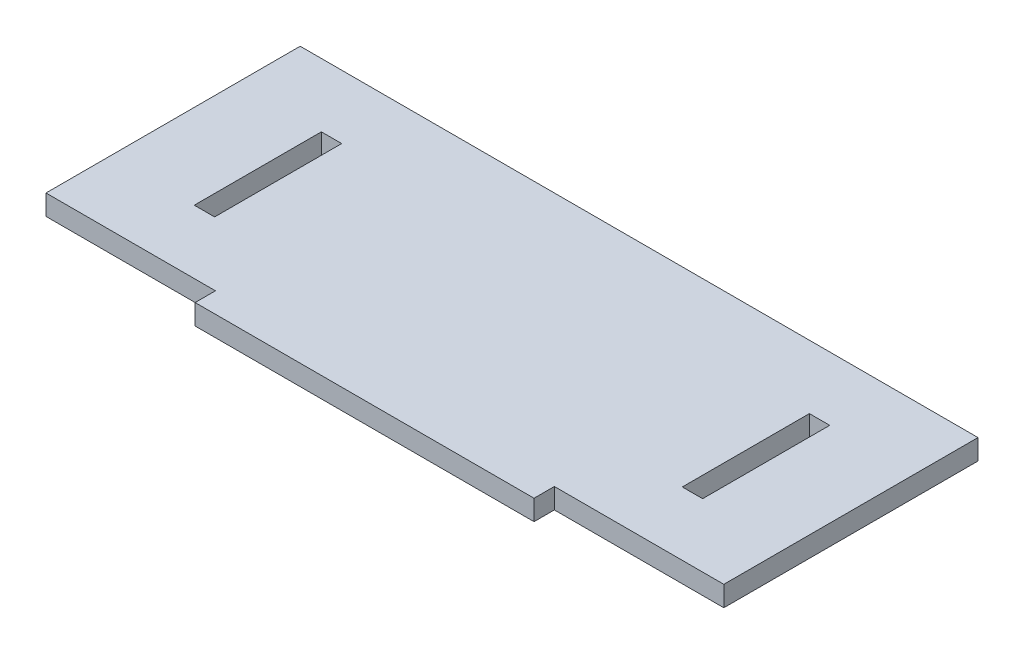
ISO-10303-21;
HEADER;
FILE_DESCRIPTION(('STEP AP214'),'2;1');
FILE_NAME('part.step','',(''),(''),'','','');
FILE_SCHEMA(('AUTOMOTIVE_DESIGN { 1 0 10303 214 1 1 1 1 }'));
ENDSEC;
DATA;
#1=APPLICATION_CONTEXT('core data for automotive mechanical design processes');
#2=APPLICATION_PROTOCOL_DEFINITION('international standard','automotive_design',2000,#1);
#3=PRODUCT_CONTEXT('',#1,'mechanical');
#4=PRODUCT('Part','Part','',(#3));
#5=PRODUCT_RELATED_PRODUCT_CATEGORY('part','',(#4));
#6=PRODUCT_DEFINITION_FORMATION('','',#4);
#7=PRODUCT_DEFINITION_CONTEXT('part definition',#1,'design');
#8=PRODUCT_DEFINITION('design','',#6,#7);
#9=PRODUCT_DEFINITION_SHAPE('','',#8);
#10=(LENGTH_UNIT() NAMED_UNIT(*) SI_UNIT(.MILLI.,.METRE.));
#11=(NAMED_UNIT(*) PLANE_ANGLE_UNIT() SI_UNIT($,.RADIAN.));
#12=(NAMED_UNIT(*) SI_UNIT($,.STERADIAN.) SOLID_ANGLE_UNIT());
#13=UNCERTAINTY_MEASURE_WITH_UNIT(LENGTH_MEASURE(1.E-05),#10,'distance_accuracy_value','');
#14=(GEOMETRIC_REPRESENTATION_CONTEXT(3) GLOBAL_UNCERTAINTY_ASSIGNED_CONTEXT((#13)) GLOBAL_UNIT_ASSIGNED_CONTEXT((#10,
#11,#12)) REPRESENTATION_CONTEXT('',''));
#15=CARTESIAN_POINT('',(0.,0.,0.));
#16=DIRECTION('',(0.,0.,1.));
#17=DIRECTION('',(1.,0.,0.));
#18=AXIS2_PLACEMENT_3D('',#15,#16,#17);
#19=CARTESIAN_POINT('',(0.,12.,75.));
#20=DIRECTION('',(0.,0.,-1.));
#21=DIRECTION('',(-1.,0.,0.));
#22=AXIS2_PLACEMENT_3D('',#19,#20,#21);
#23=PLANE('',#22);
#24=DIRECTION('',(1.,0.,0.));
#25=VECTOR('',#24,1.);
#26=CARTESIAN_POINT('',(0.,0.,75.));
#27=LINE('',#26,#25);
#28=CARTESIAN_POINT('',(-200.,0.,75.));
#29=VERTEX_POINT('',#28);
#30=CARTESIAN_POINT('',(-100.,0.,75.));
#31=VERTEX_POINT('',#30);
#32=EDGE_CURVE('E228',#29,#31,#27,.T.);
#33=ORIENTED_EDGE('',*,*,#32,.T.);
#34=DIRECTION('',(0.,-1.,0.));
#35=VECTOR('',#34,1.);
#36=CARTESIAN_POINT('',(-100.,12.,75.));
#37=LINE('',#36,#35);
#38=CARTESIAN_POINT('',(-100.,12.,75.));
#39=VERTEX_POINT('',#38);
#40=EDGE_CURVE('E11',#39,#31,#37,.T.);
#41=ORIENTED_EDGE('',*,*,#40,.F.);
#42=DIRECTION('',(1.,0.,0.));
#43=VECTOR('',#42,1.);
#44=CARTESIAN_POINT('',(0.,12.,75.));
#45=LINE('',#44,#43);
#46=CARTESIAN_POINT('',(-200.,12.,75.));
#47=VERTEX_POINT('',#46);
#48=EDGE_CURVE('E229',#47,#39,#45,.T.);
#49=ORIENTED_EDGE('',*,*,#48,.F.);
#50=DIRECTION('',(0.,-1.,0.));
#51=VECTOR('',#50,1.);
#52=CARTESIAN_POINT('',(-200.,12.,75.));
#53=LINE('',#52,#51);
#54=EDGE_CURVE('E256',#47,#29,#53,.T.);
#55=ORIENTED_EDGE('',*,*,#54,.T.);
#56=EDGE_LOOP('',(#33,#41,#49,#55));
#57=FACE_BOUND('',#56,.T.);
#58=ADVANCED_FACE('F44',(#57),#23,.F.);
#59=CARTESIAN_POINT('',(-100.,12.,0.));
#60=DIRECTION('',(1.,0.,0.));
#61=DIRECTION('',(0.,0.,-1.));
#62=AXIS2_PLACEMENT_3D('',#59,#60,#61);
#63=PLANE('',#62);
#64=DIRECTION('',(0.,0.,1.));
#65=VECTOR('',#64,1.);
#66=CARTESIAN_POINT('',(-100.,0.,0.));
#67=LINE('',#66,#65);
#68=CARTESIAN_POINT('',(-100.,0.,87.));
#69=VERTEX_POINT('',#68);
#70=EDGE_CURVE('E260',#31,#69,#67,.T.);
#71=ORIENTED_EDGE('',*,*,#70,.T.);
#72=DIRECTION('',(0.,-1.,0.));
#73=VECTOR('',#72,1.);
#74=CARTESIAN_POINT('',(-100.,12.,87.));
#75=LINE('',#74,#73);
#76=CARTESIAN_POINT('',(-100.,12.,87.));
#77=VERTEX_POINT('',#76);
#78=EDGE_CURVE('E53',#77,#69,#75,.T.);
#79=ORIENTED_EDGE('',*,*,#78,.F.);
#80=DIRECTION('',(0.,0.,1.));
#81=VECTOR('',#80,1.);
#82=CARTESIAN_POINT('',(-100.,12.,0.));
#83=LINE('',#82,#81);
#84=EDGE_CURVE('E233',#39,#77,#83,.T.);
#85=ORIENTED_EDGE('',*,*,#84,.F.);
#86=ORIENTED_EDGE('',*,*,#40,.T.);
#87=EDGE_LOOP('',(#71,#79,#85,#86));
#88=FACE_BOUND('',#87,.T.);
#89=ADVANCED_FACE('F46',(#88),#63,.F.);
#90=CARTESIAN_POINT('',(0.,12.,87.));
#91=DIRECTION('',(0.,0.,-1.));
#92=DIRECTION('',(-1.,0.,0.));
#93=AXIS2_PLACEMENT_3D('',#90,#91,#92);
#94=PLANE('',#93);
#95=DIRECTION('',(1.,0.,0.));
#96=VECTOR('',#95,1.);
#97=CARTESIAN_POINT('',(0.,0.,87.));
#98=LINE('',#97,#96);
#99=CARTESIAN_POINT('',(100.,0.,87.));
#100=VERTEX_POINT('',#99);
#101=EDGE_CURVE('E264',#69,#100,#98,.T.);
#102=ORIENTED_EDGE('',*,*,#101,.T.);
#103=DIRECTION('',(0.,-1.,0.));
#104=VECTOR('',#103,1.);
#105=CARTESIAN_POINT('',(100.,12.,87.));
#106=LINE('',#105,#104);
#107=CARTESIAN_POINT('',(100.,12.,87.));
#108=VERTEX_POINT('',#107);
#109=EDGE_CURVE('E297',#108,#100,#106,.T.);
#110=ORIENTED_EDGE('',*,*,#109,.F.);
#111=DIRECTION('',(1.,0.,0.));
#112=VECTOR('',#111,1.);
#113=CARTESIAN_POINT('',(0.,12.,87.));
#114=LINE('',#113,#112);
#115=EDGE_CURVE('E238',#77,#108,#114,.T.);
#116=ORIENTED_EDGE('',*,*,#115,.F.);
#117=ORIENTED_EDGE('',*,*,#78,.T.);
#118=EDGE_LOOP('',(#102,#110,#116,#117));
#119=FACE_BOUND('',#118,.T.);
#120=ADVANCED_FACE('F305',(#119),#94,.F.);
#121=CARTESIAN_POINT('',(99.9999999999999,12.,-1.15648231731787E-13));
#122=DIRECTION('',(1.,0.,0.));
#123=DIRECTION('',(0.,0.,-1.));
#124=AXIS2_PLACEMENT_3D('',#121,#122,#123);
#125=PLANE('',#124);
#126=DIRECTION('',(0.,0.,1.));
#127=VECTOR('',#126,1.);
#128=CARTESIAN_POINT('',(99.9999999999999,0.,-1.15648231731787E-13));
#129=LINE('',#128,#127);
#130=CARTESIAN_POINT('',(100.,0.,75.));
#131=VERTEX_POINT('',#130);
#132=EDGE_CURVE('E268',#131,#100,#129,.T.);
#133=ORIENTED_EDGE('',*,*,#132,.F.);
#134=DIRECTION('',(0.,-1.,0.));
#135=VECTOR('',#134,1.);
#136=CARTESIAN_POINT('',(100.,12.,75.));
#137=LINE('',#136,#135);
#138=CARTESIAN_POINT('',(100.,12.,75.));
#139=VERTEX_POINT('',#138);
#140=EDGE_CURVE('E294',#139,#131,#137,.T.);
#141=ORIENTED_EDGE('',*,*,#140,.F.);
#142=DIRECTION('',(0.,0.,1.));
#143=VECTOR('',#142,1.);
#144=CARTESIAN_POINT('',(99.9999999999999,12.,-1.15648231731787E-13));
#145=LINE('',#144,#143);
#146=EDGE_CURVE('E241',#139,#108,#145,.T.);
#147=ORIENTED_EDGE('',*,*,#146,.T.);
#148=ORIENTED_EDGE('',*,*,#109,.T.);
#149=EDGE_LOOP('',(#133,#141,#147,#148));
#150=FACE_BOUND('',#149,.T.);
#151=ADVANCED_FACE('F315',(#150),#125,.T.);
#152=CARTESIAN_POINT('',(200.,0.,75.));
#153=VERTEX_POINT('',#152);
#154=EDGE_CURVE('E261',#131,#153,#27,.T.);
#155=ORIENTED_EDGE('',*,*,#154,.T.);
#156=DIRECTION('',(0.,-1.,0.));
#157=VECTOR('',#156,1.);
#158=CARTESIAN_POINT('',(200.,12.,75.));
#159=LINE('',#158,#157);
#160=CARTESIAN_POINT('',(200.,12.,75.));
#161=VERTEX_POINT('',#160);
#162=EDGE_CURVE('E291',#161,#153,#159,.T.);
#163=ORIENTED_EDGE('',*,*,#162,.F.);
#164=EDGE_CURVE('E235',#139,#161,#45,.T.);
#165=ORIENTED_EDGE('',*,*,#164,.F.);
#166=ORIENTED_EDGE('',*,*,#140,.T.);
#167=EDGE_LOOP('',(#155,#163,#165,#166));
#168=FACE_BOUND('',#167,.T.);
#169=ADVANCED_FACE('F336',(#168),#23,.F.);
#170=CARTESIAN_POINT('',(200.,12.,0.));
#171=DIRECTION('',(1.,0.,0.));
#172=DIRECTION('',(0.,0.,-1.));
#173=AXIS2_PLACEMENT_3D('',#170,#171,#172);
#174=PLANE('',#173);
#175=DIRECTION('',(0.,0.,1.));
#176=VECTOR('',#175,1.);
#177=CARTESIAN_POINT('',(200.,0.,0.));
#178=LINE('',#177,#176);
#179=CARTESIAN_POINT('',(200.,0.,-75.));
#180=VERTEX_POINT('',#179);
#181=EDGE_CURVE('E272',#180,#153,#178,.T.);
#182=ORIENTED_EDGE('',*,*,#181,.F.);
#183=DIRECTION('',(0.,-1.,0.));
#184=VECTOR('',#183,1.);
#185=CARTESIAN_POINT('',(200.,12.,-75.));
#186=LINE('',#185,#184);
#187=CARTESIAN_POINT('',(200.,12.,-75.));
#188=VERTEX_POINT('',#187);
#189=EDGE_CURVE('E288',#188,#180,#186,.T.);
#190=ORIENTED_EDGE('',*,*,#189,.F.);
#191=DIRECTION('',(0.,0.,1.));
#192=VECTOR('',#191,1.);
#193=CARTESIAN_POINT('',(200.,12.,0.));
#194=LINE('',#193,#192);
#195=EDGE_CURVE('E245',#188,#161,#194,.T.);
#196=ORIENTED_EDGE('',*,*,#195,.T.);
#197=ORIENTED_EDGE('',*,*,#162,.T.);
#198=EDGE_LOOP('',(#182,#190,#196,#197));
#199=FACE_BOUND('',#198,.T.);
#200=ADVANCED_FACE('F334',(#199),#174,.T.);
#201=CARTESIAN_POINT('',(0.,12.,-75.));
#202=DIRECTION('',(0.,0.,-1.));
#203=DIRECTION('',(-1.,0.,0.));
#204=AXIS2_PLACEMENT_3D('',#201,#202,#203);
#205=PLANE('',#204);
#206=DIRECTION('',(1.,0.,0.));
#207=VECTOR('',#206,1.);
#208=CARTESIAN_POINT('',(0.,0.,-75.));
#209=LINE('',#208,#207);
#210=CARTESIAN_POINT('',(-200.,0.,-75.));
#211=VERTEX_POINT('',#210);
#212=EDGE_CURVE('E276',#211,#180,#209,.T.);
#213=ORIENTED_EDGE('',*,*,#212,.F.);
#214=DIRECTION('',(0.,-1.,0.));
#215=VECTOR('',#214,1.);
#216=CARTESIAN_POINT('',(-200.,12.,-75.));
#217=LINE('',#216,#215);
#218=CARTESIAN_POINT('',(-200.,12.,-75.));
#219=VERTEX_POINT('',#218);
#220=EDGE_CURVE('E285',#219,#211,#217,.T.);
#221=ORIENTED_EDGE('',*,*,#220,.F.);
#222=DIRECTION('',(1.,0.,0.));
#223=VECTOR('',#222,1.);
#224=CARTESIAN_POINT('',(0.,12.,-75.));
#225=LINE('',#224,#223);
#226=EDGE_CURVE('E249',#219,#188,#225,.T.);
#227=ORIENTED_EDGE('',*,*,#226,.T.);
#228=ORIENTED_EDGE('',*,*,#189,.T.);
#229=EDGE_LOOP('',(#213,#221,#227,#228));
#230=FACE_BOUND('',#229,.T.);
#231=ADVANCED_FACE('F329',(#230),#205,.T.);
#232=CARTESIAN_POINT('',(-200.,12.,0.));
#233=DIRECTION('',(1.,0.,0.));
#234=DIRECTION('',(0.,0.,-1.));
#235=AXIS2_PLACEMENT_3D('',#232,#233,#234);
#236=PLANE('',#235);
#237=DIRECTION('',(0.,0.,1.));
#238=VECTOR('',#237,1.);
#239=CARTESIAN_POINT('',(-200.,0.,0.));
#240=LINE('',#239,#238);
#241=EDGE_CURVE('E234',#211,#29,#240,.T.);
#242=ORIENTED_EDGE('',*,*,#241,.T.);
#243=ORIENTED_EDGE('',*,*,#54,.F.);
#244=DIRECTION('',(0.,0.,1.));
#245=VECTOR('',#244,1.);
#246=CARTESIAN_POINT('',(-200.,12.,0.));
#247=LINE('',#246,#245);
#248=EDGE_CURVE('E253',#219,#47,#247,.T.);
#249=ORIENTED_EDGE('',*,*,#248,.F.);
#250=ORIENTED_EDGE('',*,*,#220,.T.);
#251=EDGE_LOOP('',(#242,#243,#249,#250));
#252=FACE_BOUND('',#251,.T.);
#253=ADVANCED_FACE('F382',(#252),#236,.F.);
#254=CARTESIAN_POINT('',(0.,12.,0.));
#255=DIRECTION('',(0.,1.,0.));
#256=DIRECTION('',(0.,0.,1.));
#257=AXIS2_PLACEMENT_3D('',#254,#255,#256);
#258=PLANE('',#257);
#259=DIRECTION('',(-1.,0.,0.));
#260=VECTOR('',#259,1.);
#261=CARTESIAN_POINT('',(150.,12.,37.5));
#262=LINE('',#261,#260);
#263=CARTESIAN_POINT('',(150.,12.,37.5));
#264=VERTEX_POINT('',#263);
#265=CARTESIAN_POINT('',(138.,12.,37.5));
#266=VERTEX_POINT('',#265);
#267=EDGE_CURVE('E160',#264,#266,#262,.T.);
#268=ORIENTED_EDGE('',*,*,#267,.T.);
#269=DIRECTION('',(0.,0.,-1.));
#270=VECTOR('',#269,1.);
#271=CARTESIAN_POINT('',(138.,12.,37.5));
#272=LINE('',#271,#270);
#273=CARTESIAN_POINT('',(138.,12.,-37.5));
#274=VERTEX_POINT('',#273);
#275=EDGE_CURVE('E167',#266,#274,#272,.T.);
#276=ORIENTED_EDGE('',*,*,#275,.T.);
#277=DIRECTION('',(-1.,0.,0.));
#278=VECTOR('',#277,1.);
#279=CARTESIAN_POINT('',(150.,12.,-37.5));
#280=LINE('',#279,#278);
#281=CARTESIAN_POINT('',(150.,12.,-37.5));
#282=VERTEX_POINT('',#281);
#283=EDGE_CURVE('E60',#282,#274,#280,.T.);
#284=ORIENTED_EDGE('',*,*,#283,.F.);
#285=DIRECTION('',(0.,0.,-1.));
#286=VECTOR('',#285,1.);
#287=CARTESIAN_POINT('',(150.,12.,37.5));
#288=LINE('',#287,#286);
#289=EDGE_CURVE('E178',#264,#282,#288,.T.);
#290=ORIENTED_EDGE('',*,*,#289,.F.);
#291=EDGE_LOOP('',(#268,#276,#284,#290));
#292=FACE_BOUND('',#291,.T.);
#293=DIRECTION('',(1.,0.,0.));
#294=VECTOR('',#293,1.);
#295=CARTESIAN_POINT('',(-150.,12.,37.5));
#296=LINE('',#295,#294);
#297=CARTESIAN_POINT('',(-150.,12.,37.5));
#298=VERTEX_POINT('',#297);
#299=CARTESIAN_POINT('',(-138.,12.,37.5));
#300=VERTEX_POINT('',#299);
#301=EDGE_CURVE('E180',#298,#300,#296,.T.);
#302=ORIENTED_EDGE('',*,*,#301,.F.);
#303=DIRECTION('',(0.,0.,-1.));
#304=VECTOR('',#303,1.);
#305=CARTESIAN_POINT('',(-150.,12.,37.5));
#306=LINE('',#305,#304);
#307=CARTESIAN_POINT('',(-150.,12.,-37.5));
#308=VERTEX_POINT('',#307);
#309=EDGE_CURVE('E210',#298,#308,#306,.T.);
#310=ORIENTED_EDGE('',*,*,#309,.T.);
#311=DIRECTION('',(1.,0.,0.));
#312=VECTOR('',#311,1.);
#313=CARTESIAN_POINT('',(-150.,12.,-37.5));
#314=LINE('',#313,#312);
#315=CARTESIAN_POINT('',(-138.,12.,-37.5));
#316=VERTEX_POINT('',#315);
#317=EDGE_CURVE('E206',#308,#316,#314,.T.);
#318=ORIENTED_EDGE('',*,*,#317,.T.);
#319=DIRECTION('',(0.,0.,-1.));
#320=VECTOR('',#319,1.);
#321=CARTESIAN_POINT('',(-138.,12.,37.5));
#322=LINE('',#321,#320);
#323=EDGE_CURVE('E184',#300,#316,#322,.T.);
#324=ORIENTED_EDGE('',*,*,#323,.F.);
#325=EDGE_LOOP('',(#302,#310,#318,#324));
#326=FACE_BOUND('',#325,.T.);
#327=ORIENTED_EDGE('',*,*,#48,.T.);
#328=ORIENTED_EDGE('',*,*,#84,.T.);
#329=ORIENTED_EDGE('',*,*,#115,.T.);
#330=ORIENTED_EDGE('',*,*,#146,.F.);
#331=ORIENTED_EDGE('',*,*,#164,.T.);
#332=ORIENTED_EDGE('',*,*,#195,.F.);
#333=ORIENTED_EDGE('',*,*,#226,.F.);
#334=ORIENTED_EDGE('',*,*,#248,.T.);
#335=EDGE_LOOP('',(#327,#328,#329,#330,#331,#332,#333,#334));
#336=FACE_BOUND('',#335,.T.);
#337=ADVANCED_FACE('F175',(#292,#326,#336),#258,.T.);
#338=CARTESIAN_POINT('',(0.,0.,0.));
#339=DIRECTION('',(0.,1.,0.));
#340=DIRECTION('',(0.,0.,1.));
#341=AXIS2_PLACEMENT_3D('',#338,#339,#340);
#342=PLANE('',#341);
#343=DIRECTION('',(0.,0.,1.));
#344=VECTOR('',#343,1.);
#345=CARTESIAN_POINT('',(138.,0.,37.5));
#346=LINE('',#345,#344);
#347=CARTESIAN_POINT('',(138.,0.,-37.5));
#348=VERTEX_POINT('',#347);
#349=CARTESIAN_POINT('',(138.,0.,37.5));
#350=VERTEX_POINT('',#349);
#351=EDGE_CURVE('E173',#348,#350,#346,.T.);
#352=ORIENTED_EDGE('',*,*,#351,.T.);
#353=DIRECTION('',(1.,0.,0.));
#354=VECTOR('',#353,1.);
#355=CARTESIAN_POINT('',(150.,0.,37.5));
#356=LINE('',#355,#354);
#357=CARTESIAN_POINT('',(150.,0.,37.5));
#358=VERTEX_POINT('',#357);
#359=EDGE_CURVE('E68',#350,#358,#356,.T.);
#360=ORIENTED_EDGE('',*,*,#359,.T.);
#361=DIRECTION('',(0.,0.,1.));
#362=VECTOR('',#361,1.);
#363=CARTESIAN_POINT('',(150.,0.,37.5));
#364=LINE('',#363,#362);
#365=CARTESIAN_POINT('',(150.,0.,-37.5));
#366=VERTEX_POINT('',#365);
#367=EDGE_CURVE('E186',#366,#358,#364,.T.);
#368=ORIENTED_EDGE('',*,*,#367,.F.);
#369=DIRECTION('',(1.,0.,0.));
#370=VECTOR('',#369,1.);
#371=CARTESIAN_POINT('',(150.,0.,-37.5));
#372=LINE('',#371,#370);
#373=EDGE_CURVE('E537',#348,#366,#372,.T.);
#374=ORIENTED_EDGE('',*,*,#373,.F.);
#375=EDGE_LOOP('',(#352,#360,#368,#374));
#376=FACE_BOUND('',#375,.T.);
#377=DIRECTION('',(0.,0.,1.));
#378=VECTOR('',#377,1.);
#379=CARTESIAN_POINT('',(-150.,0.,37.5));
#380=LINE('',#379,#378);
#381=CARTESIAN_POINT('',(-150.,0.,-37.5));
#382=VERTEX_POINT('',#381);
#383=CARTESIAN_POINT('',(-150.,0.,37.5));
#384=VERTEX_POINT('',#383);
#385=EDGE_CURVE('E194',#382,#384,#380,.T.);
#386=ORIENTED_EDGE('',*,*,#385,.T.);
#387=DIRECTION('',(-1.,0.,0.));
#388=VECTOR('',#387,1.);
#389=CARTESIAN_POINT('',(-150.,0.,37.5));
#390=LINE('',#389,#388);
#391=CARTESIAN_POINT('',(-138.,0.,37.5));
#392=VERTEX_POINT('',#391);
#393=EDGE_CURVE('E199',#392,#384,#390,.T.);
#394=ORIENTED_EDGE('',*,*,#393,.F.);
#395=DIRECTION('',(0.,0.,1.));
#396=VECTOR('',#395,1.);
#397=CARTESIAN_POINT('',(-138.,0.,37.5));
#398=LINE('',#397,#396);
#399=CARTESIAN_POINT('',(-138.,0.,-37.5));
#400=VERTEX_POINT('',#399);
#401=EDGE_CURVE('E201',#400,#392,#398,.T.);
#402=ORIENTED_EDGE('',*,*,#401,.F.);
#403=DIRECTION('',(-1.,0.,0.));
#404=VECTOR('',#403,1.);
#405=CARTESIAN_POINT('',(-150.,0.,-37.5));
#406=LINE('',#405,#404);
#407=EDGE_CURVE('E190',#400,#382,#406,.T.);
#408=ORIENTED_EDGE('',*,*,#407,.T.);
#409=EDGE_LOOP('',(#386,#394,#402,#408));
#410=FACE_BOUND('',#409,.T.);
#411=ORIENTED_EDGE('',*,*,#32,.F.);
#412=ORIENTED_EDGE('',*,*,#241,.F.);
#413=ORIENTED_EDGE('',*,*,#212,.T.);
#414=ORIENTED_EDGE('',*,*,#181,.T.);
#415=ORIENTED_EDGE('',*,*,#154,.F.);
#416=ORIENTED_EDGE('',*,*,#132,.T.);
#417=ORIENTED_EDGE('',*,*,#101,.F.);
#418=ORIENTED_EDGE('',*,*,#70,.F.);
#419=EDGE_LOOP('',(#411,#412,#413,#414,#415,#416,#417,#418));
#420=FACE_BOUND('',#419,.T.);
#421=ADVANCED_FACE('F310',(#376,#410,#420),#342,.F.);
#422=CARTESIAN_POINT('',(-150.,-75.953933407033,37.5));
#423=DIRECTION('',(0.,0.,1.));
#424=DIRECTION('',(1.,0.,0.));
#425=AXIS2_PLACEMENT_3D('',#422,#423,#424);
#426=PLANE('',#425);
#427=ORIENTED_EDGE('',*,*,#393,.T.);
#428=DIRECTION('',(0.,1.,0.));
#429=VECTOR('',#428,1.);
#430=CARTESIAN_POINT('',(-150.,-75.953933407033,37.5));
#431=LINE('',#430,#429);
#432=EDGE_CURVE('E195',#384,#298,#431,.T.);
#433=ORIENTED_EDGE('',*,*,#432,.T.);
#434=ORIENTED_EDGE('',*,*,#301,.T.);
#435=DIRECTION('',(0.,1.,0.));
#436=VECTOR('',#435,1.);
#437=CARTESIAN_POINT('',(-138.,-75.953933407033,37.5));
#438=LINE('',#437,#436);
#439=EDGE_CURVE('E214',#392,#300,#438,.T.);
#440=ORIENTED_EDGE('',*,*,#439,.F.);
#441=EDGE_LOOP('',(#427,#433,#434,#440));
#442=FACE_BOUND('',#441,.T.);
#443=ADVANCED_FACE('F399',(#442),#426,.F.);
#444=CARTESIAN_POINT('',(-150.,-75.953933407033,37.5));
#445=DIRECTION('',(1.,0.,0.));
#446=DIRECTION('',(0.,0.,-1.));
#447=AXIS2_PLACEMENT_3D('',#444,#445,#446);
#448=PLANE('',#447);
#449=DIRECTION('',(0.,1.,0.));
#450=VECTOR('',#449,1.);
#451=CARTESIAN_POINT('',(-150.,-75.953933407033,-37.5));
#452=LINE('',#451,#450);
#453=EDGE_CURVE('E217',#382,#308,#452,.T.);
#454=ORIENTED_EDGE('',*,*,#453,.T.);
#455=ORIENTED_EDGE('',*,*,#309,.F.);
#456=ORIENTED_EDGE('',*,*,#432,.F.);
#457=ORIENTED_EDGE('',*,*,#385,.F.);
#458=EDGE_LOOP('',(#454,#455,#456,#457));
#459=FACE_BOUND('',#458,.T.);
#460=ADVANCED_FACE('F404',(#459),#448,.T.);
#461=CARTESIAN_POINT('',(-150.,-75.953933407033,-37.5));
#462=DIRECTION('',(0.,0.,1.));
#463=DIRECTION('',(1.,0.,0.));
#464=AXIS2_PLACEMENT_3D('',#461,#462,#463);
#465=PLANE('',#464);
#466=DIRECTION('',(0.,1.,0.));
#467=VECTOR('',#466,1.);
#468=CARTESIAN_POINT('',(-138.,-75.953933407033,-37.5));
#469=LINE('',#468,#467);
#470=EDGE_CURVE('E220',#400,#316,#469,.T.);
#471=ORIENTED_EDGE('',*,*,#470,.T.);
#472=ORIENTED_EDGE('',*,*,#317,.F.);
#473=ORIENTED_EDGE('',*,*,#453,.F.);
#474=ORIENTED_EDGE('',*,*,#407,.F.);
#475=EDGE_LOOP('',(#471,#472,#473,#474));
#476=FACE_BOUND('',#475,.T.);
#477=ADVANCED_FACE('F417',(#476),#465,.T.);
#478=CARTESIAN_POINT('',(-138.,-75.953933407033,37.5));
#479=DIRECTION('',(1.,0.,0.));
#480=DIRECTION('',(0.,0.,-1.));
#481=AXIS2_PLACEMENT_3D('',#478,#479,#480);
#482=PLANE('',#481);
#483=ORIENTED_EDGE('',*,*,#401,.T.);
#484=ORIENTED_EDGE('',*,*,#439,.T.);
#485=ORIENTED_EDGE('',*,*,#323,.T.);
#486=ORIENTED_EDGE('',*,*,#470,.F.);
#487=EDGE_LOOP('',(#483,#484,#485,#486));
#488=FACE_BOUND('',#487,.T.);
#489=ADVANCED_FACE('F428',(#488),#482,.F.);
#490=CARTESIAN_POINT('',(150.,-75.953933407033,37.5));
#491=DIRECTION('',(0.,0.,1.));
#492=DIRECTION('',(-1.,0.,0.));
#493=AXIS2_PLACEMENT_3D('',#490,#491,#492);
#494=PLANE('',#493);
#495=ORIENTED_EDGE('',*,*,#359,.F.);
#496=DIRECTION('',(0.,1.,0.));
#497=VECTOR('',#496,1.);
#498=CARTESIAN_POINT('',(138.,-75.953933407033,37.5));
#499=LINE('',#498,#497);
#500=EDGE_CURVE('E156',#350,#266,#499,.T.);
#501=ORIENTED_EDGE('',*,*,#500,.T.);
#502=ORIENTED_EDGE('',*,*,#267,.F.);
#503=DIRECTION('',(0.,1.,0.));
#504=VECTOR('',#503,1.);
#505=CARTESIAN_POINT('',(150.,-75.953933407033,37.5));
#506=LINE('',#505,#504);
#507=EDGE_CURVE('E550',#358,#264,#506,.T.);
#508=ORIENTED_EDGE('',*,*,#507,.F.);
#509=EDGE_LOOP('',(#495,#501,#502,#508));
#510=FACE_BOUND('',#509,.T.);
#511=ADVANCED_FACE('F158',(#510),#494,.F.);
#512=CARTESIAN_POINT('',(150.,-75.953933407033,37.5));
#513=DIRECTION('',(-1.,0.,0.));
#514=DIRECTION('',(0.,0.,-1.));
#515=AXIS2_PLACEMENT_3D('',#512,#513,#514);
#516=PLANE('',#515);
#517=DIRECTION('',(0.,1.,0.));
#518=VECTOR('',#517,1.);
#519=CARTESIAN_POINT('',(150.,-75.953933407033,-37.5));
#520=LINE('',#519,#518);
#521=EDGE_CURVE('E546',#366,#282,#520,.T.);
#522=ORIENTED_EDGE('',*,*,#521,.F.);
#523=ORIENTED_EDGE('',*,*,#367,.T.);
#524=ORIENTED_EDGE('',*,*,#507,.T.);
#525=ORIENTED_EDGE('',*,*,#289,.T.);
#526=EDGE_LOOP('',(#522,#523,#524,#525));
#527=FACE_BOUND('',#526,.T.);
#528=ADVANCED_FACE('F464',(#527),#516,.T.);
#529=CARTESIAN_POINT('',(150.,-75.953933407033,-37.5));
#530=DIRECTION('',(0.,0.,1.));
#531=DIRECTION('',(-1.,0.,0.));
#532=AXIS2_PLACEMENT_3D('',#529,#530,#531);
#533=PLANE('',#532);
#534=DIRECTION('',(0.,1.,0.));
#535=VECTOR('',#534,1.);
#536=CARTESIAN_POINT('',(138.,-75.953933407033,-37.5));
#537=LINE('',#536,#535);
#538=EDGE_CURVE('E166',#348,#274,#537,.T.);
#539=ORIENTED_EDGE('',*,*,#538,.F.);
#540=ORIENTED_EDGE('',*,*,#373,.T.);
#541=ORIENTED_EDGE('',*,*,#521,.T.);
#542=ORIENTED_EDGE('',*,*,#283,.T.);
#543=EDGE_LOOP('',(#539,#540,#541,#542));
#544=FACE_BOUND('',#543,.T.);
#545=ADVANCED_FACE('F474',(#544),#533,.T.);
#546=CARTESIAN_POINT('',(138.,-75.953933407033,37.5));
#547=DIRECTION('',(-1.,0.,0.));
#548=DIRECTION('',(0.,0.,-1.));
#549=AXIS2_PLACEMENT_3D('',#546,#547,#548);
#550=PLANE('',#549);
#551=ORIENTED_EDGE('',*,*,#351,.F.);
#552=ORIENTED_EDGE('',*,*,#538,.T.);
#553=ORIENTED_EDGE('',*,*,#275,.F.);
#554=ORIENTED_EDGE('',*,*,#500,.F.);
#555=EDGE_LOOP('',(#551,#552,#553,#554));
#556=FACE_BOUND('',#555,.T.);
#557=ADVANCED_FACE('F170',(#556),#550,.F.);
#558=CLOSED_SHELL('',(#58,#89,#120,#151,#169,#200,#231,#253,#337,#421,#443,#460,#477,#489,#511,
#528,#545,#557));
#559=MANIFOLD_SOLID_BREP('B2',#558);
#560=ADVANCED_BREP_SHAPE_REPRESENTATION('',(#18,#559),#14);
#561=SHAPE_DEFINITION_REPRESENTATION(#9,#560);
ENDSEC;
END-ISO-10303-21;
